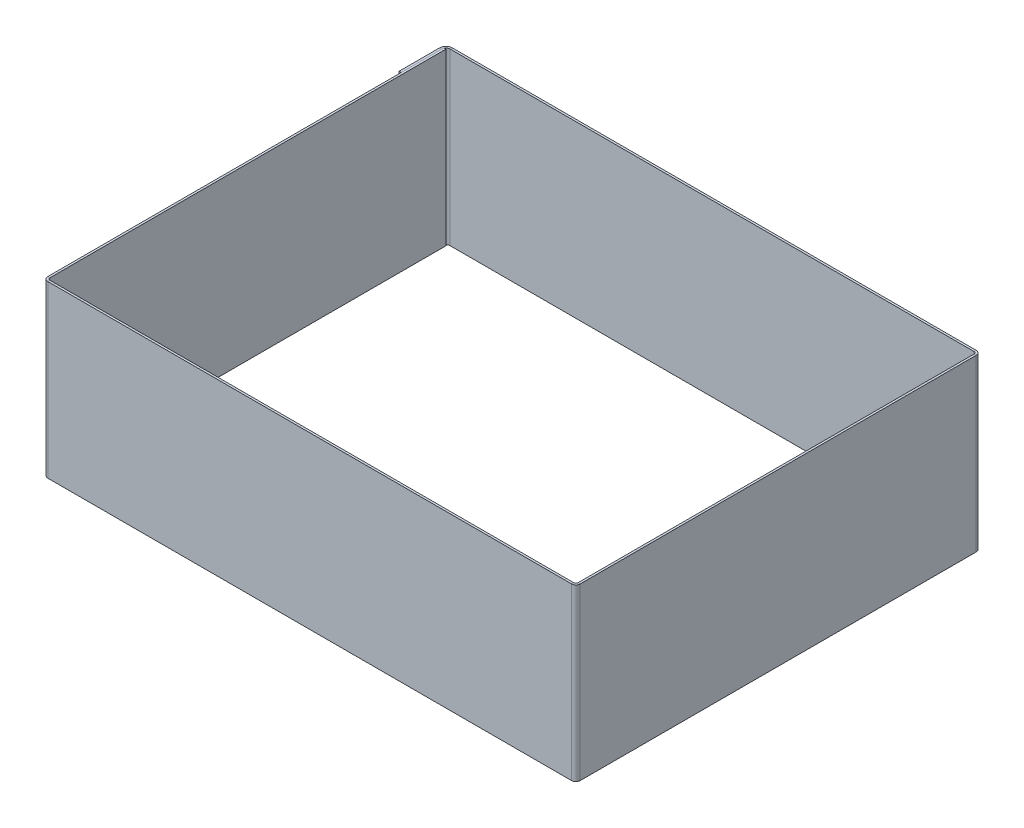
ISO-10303-21;
HEADER;
FILE_DESCRIPTION(('STEP AP214'),'2;1');
FILE_NAME('part.step','',(''),(''),'','','');
FILE_SCHEMA(('AUTOMOTIVE_DESIGN { 1 0 10303 214 1 1 1 1 }'));
ENDSEC;
DATA;
#1=APPLICATION_CONTEXT('core data for automotive mechanical design processes');
#2=APPLICATION_PROTOCOL_DEFINITION('international standard','automotive_design',2000,#1);
#3=PRODUCT_CONTEXT('',#1,'mechanical');
#4=PRODUCT('Part','Part','',(#3));
#5=PRODUCT_RELATED_PRODUCT_CATEGORY('part','',(#4));
#6=PRODUCT_DEFINITION_FORMATION('','',#4);
#7=PRODUCT_DEFINITION_CONTEXT('part definition',#1,'design');
#8=PRODUCT_DEFINITION('design','',#6,#7);
#9=PRODUCT_DEFINITION_SHAPE('','',#8);
#10=(LENGTH_UNIT() NAMED_UNIT(*) SI_UNIT(.MILLI.,.METRE.));
#11=(NAMED_UNIT(*) PLANE_ANGLE_UNIT() SI_UNIT($,.RADIAN.));
#12=(NAMED_UNIT(*) SI_UNIT($,.STERADIAN.) SOLID_ANGLE_UNIT());
#13=UNCERTAINTY_MEASURE_WITH_UNIT(LENGTH_MEASURE(1.E-05),#10,'distance_accuracy_value','');
#14=(GEOMETRIC_REPRESENTATION_CONTEXT(3) GLOBAL_UNCERTAINTY_ASSIGNED_CONTEXT((#13)) GLOBAL_UNIT_ASSIGNED_CONTEXT((#10,
#11,#12)) REPRESENTATION_CONTEXT('',''));
#15=CARTESIAN_POINT('',(0.,0.,0.));
#16=DIRECTION('',(0.,0.,1.));
#17=DIRECTION('',(1.,0.,0.));
#18=AXIS2_PLACEMENT_3D('',#15,#16,#17);
#19=CARTESIAN_POINT('',(-62.5,40.,-46.5));
#20=DIRECTION('',(0.,0.,-1.));
#21=DIRECTION('',(0.,-1.,0.));
#22=AXIS2_PLACEMENT_3D('',#19,#20,#21);
#23=PLANE('',#22);
#24=DIRECTION('',(-1.,0.,0.));
#25=VECTOR('',#24,1.);
#26=CARTESIAN_POINT('',(-62.5,40.,-46.5));
#27=LINE('',#26,#25);
#28=CARTESIAN_POINT('',(-62.,40.,-46.5));
#29=VERTEX_POINT('',#28);
#30=CARTESIAN_POINT('',(-62.5,40.,-46.5));
#31=VERTEX_POINT('',#30);
#32=EDGE_CURVE('E13',#29,#31,#27,.T.);
#33=ORIENTED_EDGE('',*,*,#32,.F.);
#34=DIRECTION('',(0.,1.,0.));
#35=VECTOR('',#34,1.);
#36=CARTESIAN_POINT('',(-62.,40.,-46.5));
#37=LINE('',#36,#35);
#38=CARTESIAN_POINT('',(-62.,0.,-46.5));
#39=VERTEX_POINT('',#38);
#40=EDGE_CURVE('E130',#29,#39,#37,.F.);
#41=ORIENTED_EDGE('',*,*,#40,.T.);
#42=DIRECTION('',(-1.,0.,0.));
#43=VECTOR('',#42,1.);
#44=CARTESIAN_POINT('',(-62.5,0.,-46.5));
#45=LINE('',#44,#43);
#46=CARTESIAN_POINT('',(-62.5,0.,-46.5));
#47=VERTEX_POINT('',#46);
#48=EDGE_CURVE('E73',#39,#47,#45,.T.);
#49=ORIENTED_EDGE('',*,*,#48,.T.);
#50=DIRECTION('',(0.,-1.,0.));
#51=VECTOR('',#50,1.);
#52=CARTESIAN_POINT('',(-62.5,40.,-46.5));
#53=LINE('',#52,#51);
#54=EDGE_CURVE('E133',#31,#47,#53,.T.);
#55=ORIENTED_EDGE('',*,*,#54,.F.);
#56=EDGE_LOOP('',(#33,#41,#49,#55));
#57=FACE_BOUND('',#56,.T.);
#58=ADVANCED_FACE('F63',(#57),#23,.T.);
#59=CARTESIAN_POINT('',(-62.5,0.,47.5));
#60=DIRECTION('',(0.,1.,0.));
#61=DIRECTION('',(0.,0.,-1.));
#62=AXIS2_PLACEMENT_3D('',#59,#60,#61);
#63=PLANE('',#62);
#64=ORIENTED_EDGE('',*,*,#48,.F.);
#65=DIRECTION('',(0.,0.,1.));
#66=VECTOR('',#65,1.);
#67=CARTESIAN_POINT('',(-62.,0.,47.5));
#68=LINE('',#67,#66);
#69=CARTESIAN_POINT('',(-62.,0.,46.5));
#70=VERTEX_POINT('',#69);
#71=EDGE_CURVE('E145',#70,#39,#68,.F.);
#72=ORIENTED_EDGE('',*,*,#71,.F.);
#73=DIRECTION('',(-1.,0.,0.));
#74=VECTOR('',#73,1.);
#75=CARTESIAN_POINT('',(-62.5,0.,46.5));
#76=LINE('',#75,#74);
#77=CARTESIAN_POINT('',(-62.5,0.,46.5));
#78=VERTEX_POINT('',#77);
#79=EDGE_CURVE('E191',#70,#78,#76,.T.);
#80=ORIENTED_EDGE('',*,*,#79,.T.);
#81=DIRECTION('',(0.,0.,-1.));
#82=VECTOR('',#81,1.);
#83=CARTESIAN_POINT('',(-62.5,0.,47.5));
#84=LINE('',#83,#82);
#85=EDGE_CURVE('E199',#78,#47,#84,.T.);
#86=ORIENTED_EDGE('',*,*,#85,.T.);
#87=EDGE_LOOP('',(#64,#72,#80,#86));
#88=FACE_BOUND('',#87,.T.);
#89=ADVANCED_FACE('F203',(#88),#63,.F.);
#90=CARTESIAN_POINT('',(-61.5,0.,46.5));
#91=DIRECTION('',(0.,1.,0.));
#92=DIRECTION('',(0.,0.,1.));
#93=AXIS2_PLACEMENT_3D('',#90,#91,#92);
#94=PLANE('',#93);
#95=ORIENTED_EDGE('',*,*,#79,.F.);
#96=CARTESIAN_POINT('',(-61.5,0.,46.5));
#97=DIRECTION('',(0.,1.,0.));
#98=DIRECTION('',(0.,0.,1.));
#99=AXIS2_PLACEMENT_3D('',#96,#97,#98);
#100=CIRCLE('',#99,0.5);
#101=CARTESIAN_POINT('',(-61.5,0.,47.));
#102=VERTEX_POINT('',#101);
#103=EDGE_CURVE('E239',#102,#70,#100,.F.);
#104=ORIENTED_EDGE('',*,*,#103,.F.);
#105=DIRECTION('',(0.,0.,1.));
#106=VECTOR('',#105,1.);
#107=CARTESIAN_POINT('',(-61.5,0.,47.5));
#108=LINE('',#107,#106);
#109=CARTESIAN_POINT('',(-61.5,0.,47.5));
#110=VERTEX_POINT('',#109);
#111=EDGE_CURVE('E188',#102,#110,#108,.T.);
#112=ORIENTED_EDGE('',*,*,#111,.T.);
#113=CARTESIAN_POINT('',(-61.5,0.,46.5));
#114=DIRECTION('',(0.,-1.,0.));
#115=DIRECTION('',(0.,0.,-1.));
#116=AXIS2_PLACEMENT_3D('',#113,#114,#115);
#117=CIRCLE('',#116,1.);
#118=EDGE_CURVE('E211',#110,#78,#117,.T.);
#119=ORIENTED_EDGE('',*,*,#118,.T.);
#120=EDGE_LOOP('',(#95,#104,#112,#119));
#121=FACE_BOUND('',#120,.T.);
#122=ADVANCED_FACE('F351',(#121),#94,.F.);
#123=CARTESIAN_POINT('',(-62.5,0.,47.5));
#124=DIRECTION('',(0.,1.,0.));
#125=DIRECTION('',(1.,0.,0.));
#126=AXIS2_PLACEMENT_3D('',#123,#124,#125);
#127=PLANE('',#126);
#128=ORIENTED_EDGE('',*,*,#111,.F.);
#129=DIRECTION('',(-1.,0.,0.));
#130=VECTOR('',#129,1.);
#131=CARTESIAN_POINT('',(-62.5,0.,47.));
#132=LINE('',#131,#130);
#133=CARTESIAN_POINT('',(61.5,0.,47.));
#134=VERTEX_POINT('',#133);
#135=EDGE_CURVE('E223',#102,#134,#132,.F.);
#136=ORIENTED_EDGE('',*,*,#135,.T.);
#137=DIRECTION('',(0.,0.,1.));
#138=VECTOR('',#137,1.);
#139=CARTESIAN_POINT('',(61.5,0.,47.5));
#140=LINE('',#139,#138);
#141=CARTESIAN_POINT('',(61.5,0.,47.5));
#142=VERTEX_POINT('',#141);
#143=EDGE_CURVE('E185',#134,#142,#140,.T.);
#144=ORIENTED_EDGE('',*,*,#143,.T.);
#145=DIRECTION('',(1.,0.,0.));
#146=VECTOR('',#145,1.);
#147=CARTESIAN_POINT('',(-62.5,0.,47.5));
#148=LINE('',#147,#146);
#149=EDGE_CURVE('E304',#110,#142,#148,.T.);
#150=ORIENTED_EDGE('',*,*,#149,.F.);
#151=EDGE_LOOP('',(#128,#136,#144,#150));
#152=FACE_BOUND('',#151,.T.);
#153=ADVANCED_FACE('F355',(#152),#127,.F.);
#154=CARTESIAN_POINT('',(61.5,0.,46.5));
#155=DIRECTION('',(0.,1.,0.));
#156=DIRECTION('',(0.,0.,1.));
#157=AXIS2_PLACEMENT_3D('',#154,#155,#156);
#158=PLANE('',#157);
#159=ORIENTED_EDGE('',*,*,#143,.F.);
#160=CARTESIAN_POINT('',(61.5,0.,46.5));
#161=DIRECTION('',(0.,-1.,0.));
#162=DIRECTION('',(0.,0.,-1.));
#163=AXIS2_PLACEMENT_3D('',#160,#161,#162);
#164=CIRCLE('',#163,0.5);
#165=CARTESIAN_POINT('',(62.,0.,46.5));
#166=VERTEX_POINT('',#165);
#167=EDGE_CURVE('E148',#166,#134,#164,.T.);
#168=ORIENTED_EDGE('',*,*,#167,.F.);
#169=DIRECTION('',(1.,0.,0.));
#170=VECTOR('',#169,1.);
#171=CARTESIAN_POINT('',(62.5,0.,46.5));
#172=LINE('',#171,#170);
#173=CARTESIAN_POINT('',(62.5,0.,46.5));
#174=VERTEX_POINT('',#173);
#175=EDGE_CURVE('E182',#166,#174,#172,.T.);
#176=ORIENTED_EDGE('',*,*,#175,.T.);
#177=CARTESIAN_POINT('',(61.5,0.,46.5));
#178=DIRECTION('',(0.,-1.,0.));
#179=DIRECTION('',(0.,0.,-1.));
#180=AXIS2_PLACEMENT_3D('',#177,#178,#179);
#181=CIRCLE('',#180,1.);
#182=EDGE_CURVE('E319',#174,#142,#181,.T.);
#183=ORIENTED_EDGE('',*,*,#182,.T.);
#184=EDGE_LOOP('',(#159,#168,#176,#183));
#185=FACE_BOUND('',#184,.T.);
#186=ADVANCED_FACE('F325',(#185),#158,.F.);
#187=CARTESIAN_POINT('',(62.5,0.,47.5));
#188=DIRECTION('',(0.,1.,0.));
#189=DIRECTION('',(0.,0.,-1.));
#190=AXIS2_PLACEMENT_3D('',#187,#188,#189);
#191=PLANE('',#190);
#192=ORIENTED_EDGE('',*,*,#175,.F.);
#193=DIRECTION('',(0.,0.,1.));
#194=VECTOR('',#193,1.);
#195=CARTESIAN_POINT('',(62.,0.,47.5));
#196=LINE('',#195,#194);
#197=CARTESIAN_POINT('',(62.,0.,-46.5));
#198=VERTEX_POINT('',#197);
#199=EDGE_CURVE('E227',#166,#198,#196,.F.);
#200=ORIENTED_EDGE('',*,*,#199,.T.);
#201=DIRECTION('',(1.,0.,0.));
#202=VECTOR('',#201,1.);
#203=CARTESIAN_POINT('',(62.5,0.,-46.5));
#204=LINE('',#203,#202);
#205=CARTESIAN_POINT('',(62.5,0.,-46.5));
#206=VERTEX_POINT('',#205);
#207=EDGE_CURVE('E179',#198,#206,#204,.T.);
#208=ORIENTED_EDGE('',*,*,#207,.T.);
#209=DIRECTION('',(0.,0.,-1.));
#210=VECTOR('',#209,1.);
#211=CARTESIAN_POINT('',(62.5,0.,47.5));
#212=LINE('',#211,#210);
#213=EDGE_CURVE('E276',#174,#206,#212,.T.);
#214=ORIENTED_EDGE('',*,*,#213,.F.);
#215=EDGE_LOOP('',(#192,#200,#208,#214));
#216=FACE_BOUND('',#215,.T.);
#217=ADVANCED_FACE('F377',(#216),#191,.F.);
#218=CARTESIAN_POINT('',(61.5,0.,-46.5));
#219=DIRECTION('',(0.,1.,0.));
#220=DIRECTION('',(0.,0.,1.));
#221=AXIS2_PLACEMENT_3D('',#218,#219,#220);
#222=PLANE('',#221);
#223=ORIENTED_EDGE('',*,*,#207,.F.);
#224=CARTESIAN_POINT('',(61.5,0.,-46.5));
#225=DIRECTION('',(0.,1.,0.));
#226=DIRECTION('',(0.,0.,1.));
#227=AXIS2_PLACEMENT_3D('',#224,#225,#226);
#228=CIRCLE('',#227,0.5);
#229=CARTESIAN_POINT('',(61.5,0.,-47.));
#230=VERTEX_POINT('',#229);
#231=EDGE_CURVE('E250',#230,#198,#228,.F.);
#232=ORIENTED_EDGE('',*,*,#231,.F.);
#233=DIRECTION('',(0.,0.,-1.));
#234=VECTOR('',#233,1.);
#235=CARTESIAN_POINT('',(61.5,0.,-47.5));
#236=LINE('',#235,#234);
#237=CARTESIAN_POINT('',(61.5,0.,-47.5));
#238=VERTEX_POINT('',#237);
#239=EDGE_CURVE('E176',#230,#238,#236,.T.);
#240=ORIENTED_EDGE('',*,*,#239,.T.);
#241=CARTESIAN_POINT('',(61.5,0.,-46.5));
#242=DIRECTION('',(0.,-1.,0.));
#243=DIRECTION('',(0.,0.,-1.));
#244=AXIS2_PLACEMENT_3D('',#241,#242,#243);
#245=CIRCLE('',#244,1.);
#246=EDGE_CURVE('E301',#238,#206,#245,.T.);
#247=ORIENTED_EDGE('',*,*,#246,.T.);
#248=EDGE_LOOP('',(#223,#232,#240,#247));
#249=FACE_BOUND('',#248,.T.);
#250=ADVANCED_FACE('F544',(#249),#222,.F.);
#251=CARTESIAN_POINT('',(-62.5,0.,-47.5));
#252=DIRECTION('',(0.,1.,0.));
#253=DIRECTION('',(1.,0.,0.));
#254=AXIS2_PLACEMENT_3D('',#251,#252,#253);
#255=PLANE('',#254);
#256=ORIENTED_EDGE('',*,*,#239,.F.);
#257=DIRECTION('',(-1.,0.,0.));
#258=VECTOR('',#257,1.);
#259=CARTESIAN_POINT('',(-62.5,0.,-47.));
#260=LINE('',#259,#258);
#261=CARTESIAN_POINT('',(-61.5,0.,-47.));
#262=VERTEX_POINT('',#261);
#263=EDGE_CURVE('E236',#262,#230,#260,.F.);
#264=ORIENTED_EDGE('',*,*,#263,.F.);
#265=DIRECTION('',(0.,0.,-1.));
#266=VECTOR('',#265,1.);
#267=CARTESIAN_POINT('',(-61.5,0.,-47.5));
#268=LINE('',#267,#266);
#269=CARTESIAN_POINT('',(-61.5,0.,-47.5));
#270=VERTEX_POINT('',#269);
#271=EDGE_CURVE('E173',#262,#270,#268,.T.);
#272=ORIENTED_EDGE('',*,*,#271,.T.);
#273=DIRECTION('',(1.,0.,0.));
#274=VECTOR('',#273,1.);
#275=CARTESIAN_POINT('',(-62.5,0.,-47.5));
#276=LINE('',#275,#274);
#277=EDGE_CURVE('E292',#270,#238,#276,.T.);
#278=ORIENTED_EDGE('',*,*,#277,.T.);
#279=EDGE_LOOP('',(#256,#264,#272,#278));
#280=FACE_BOUND('',#279,.T.);
#281=ADVANCED_FACE('F442',(#280),#255,.F.);
#282=CARTESIAN_POINT('',(-62.5,40.,-47.5));
#283=DIRECTION('',(0.,1.,0.));
#284=DIRECTION('',(1.,0.,0.));
#285=AXIS2_PLACEMENT_3D('',#282,#283,#284);
#286=PLANE('',#285);
#287=DIRECTION('',(0.,0.,-1.));
#288=VECTOR('',#287,1.);
#289=CARTESIAN_POINT('',(-61.5,40.,-47.5));
#290=LINE('',#289,#288);
#291=CARTESIAN_POINT('',(-61.5,40.,-47.));
#292=VERTEX_POINT('',#291);
#293=CARTESIAN_POINT('',(-61.5,40.,-47.5));
#294=VERTEX_POINT('',#293);
#295=EDGE_CURVE('E170',#292,#294,#290,.T.);
#296=ORIENTED_EDGE('',*,*,#295,.F.);
#297=DIRECTION('',(-1.,0.,0.));
#298=VECTOR('',#297,1.);
#299=CARTESIAN_POINT('',(-62.5,40.,-47.));
#300=LINE('',#299,#298);
#301=CARTESIAN_POINT('',(61.5,40.,-47.));
#302=VERTEX_POINT('',#301);
#303=EDGE_CURVE('E232',#292,#302,#300,.F.);
#304=ORIENTED_EDGE('',*,*,#303,.T.);
#305=DIRECTION('',(0.,0.,-1.));
#306=VECTOR('',#305,1.);
#307=CARTESIAN_POINT('',(61.5,40.,-47.5));
#308=LINE('',#307,#306);
#309=CARTESIAN_POINT('',(61.5,40.,-47.5));
#310=VERTEX_POINT('',#309);
#311=EDGE_CURVE('E167',#302,#310,#308,.T.);
#312=ORIENTED_EDGE('',*,*,#311,.T.);
#313=DIRECTION('',(1.,0.,0.));
#314=VECTOR('',#313,1.);
#315=CARTESIAN_POINT('',(-62.5,40.,-47.5));
#316=LINE('',#315,#314);
#317=EDGE_CURVE('E286',#294,#310,#316,.T.);
#318=ORIENTED_EDGE('',*,*,#317,.F.);
#319=EDGE_LOOP('',(#296,#304,#312,#318));
#320=FACE_BOUND('',#319,.T.);
#321=ADVANCED_FACE('F421',(#320),#286,.T.);
#322=CARTESIAN_POINT('',(61.5,40.,-46.5));
#323=DIRECTION('',(0.,1.,0.));
#324=DIRECTION('',(0.,0.,1.));
#325=AXIS2_PLACEMENT_3D('',#322,#323,#324);
#326=PLANE('',#325);
#327=ORIENTED_EDGE('',*,*,#311,.F.);
#328=CARTESIAN_POINT('',(61.5,40.,-46.5));
#329=DIRECTION('',(0.,1.,0.));
#330=DIRECTION('',(0.,0.,1.));
#331=AXIS2_PLACEMENT_3D('',#328,#329,#330);
#332=CIRCLE('',#331,0.5);
#333=CARTESIAN_POINT('',(62.,40.,-46.5));
#334=VERTEX_POINT('',#333);
#335=EDGE_CURVE('E247',#334,#302,#332,.T.);
#336=ORIENTED_EDGE('',*,*,#335,.F.);
#337=DIRECTION('',(1.,0.,0.));
#338=VECTOR('',#337,1.);
#339=CARTESIAN_POINT('',(62.5,40.,-46.5));
#340=LINE('',#339,#338);
#341=CARTESIAN_POINT('',(62.5,40.,-46.5));
#342=VERTEX_POINT('',#341);
#343=EDGE_CURVE('E164',#334,#342,#340,.T.);
#344=ORIENTED_EDGE('',*,*,#343,.T.);
#345=CARTESIAN_POINT('',(61.5,40.,-46.5));
#346=DIRECTION('',(0.,-1.,0.));
#347=DIRECTION('',(0.,0.,-1.));
#348=AXIS2_PLACEMENT_3D('',#345,#346,#347);
#349=CIRCLE('',#348,1.);
#350=EDGE_CURVE('E298',#342,#310,#349,.F.);
#351=ORIENTED_EDGE('',*,*,#350,.T.);
#352=EDGE_LOOP('',(#327,#336,#344,#351));
#353=FACE_BOUND('',#352,.T.);
#354=ADVANCED_FACE('F425',(#353),#326,.T.);
#355=CARTESIAN_POINT('',(62.5,40.,47.5));
#356=DIRECTION('',(0.,1.,0.));
#357=DIRECTION('',(0.,0.,-1.));
#358=AXIS2_PLACEMENT_3D('',#355,#356,#357);
#359=PLANE('',#358);
#360=ORIENTED_EDGE('',*,*,#343,.F.);
#361=DIRECTION('',(0.,0.,1.));
#362=VECTOR('',#361,1.);
#363=CARTESIAN_POINT('',(62.,40.,47.5));
#364=LINE('',#363,#362);
#365=CARTESIAN_POINT('',(62.,40.,46.5));
#366=VERTEX_POINT('',#365);
#367=EDGE_CURVE('E228',#366,#334,#364,.F.);
#368=ORIENTED_EDGE('',*,*,#367,.F.);
#369=DIRECTION('',(1.,0.,0.));
#370=VECTOR('',#369,1.);
#371=CARTESIAN_POINT('',(62.5,40.,46.5));
#372=LINE('',#371,#370);
#373=CARTESIAN_POINT('',(62.5,40.,46.5));
#374=VERTEX_POINT('',#373);
#375=EDGE_CURVE('E161',#366,#374,#372,.T.);
#376=ORIENTED_EDGE('',*,*,#375,.T.);
#377=DIRECTION('',(0.,0.,-1.));
#378=VECTOR('',#377,1.);
#379=CARTESIAN_POINT('',(62.5,40.,47.5));
#380=LINE('',#379,#378);
#381=EDGE_CURVE('E265',#374,#342,#380,.T.);
#382=ORIENTED_EDGE('',*,*,#381,.T.);
#383=EDGE_LOOP('',(#360,#368,#376,#382));
#384=FACE_BOUND('',#383,.T.);
#385=ADVANCED_FACE('F435',(#384),#359,.T.);
#386=CARTESIAN_POINT('',(61.5,40.,46.5));
#387=DIRECTION('',(0.,1.,0.));
#388=DIRECTION('',(0.,0.,1.));
#389=AXIS2_PLACEMENT_3D('',#386,#387,#388);
#390=PLANE('',#389);
#391=ORIENTED_EDGE('',*,*,#375,.F.);
#392=CARTESIAN_POINT('',(61.5,40.,46.5));
#393=DIRECTION('',(0.,-1.,0.));
#394=DIRECTION('',(0.,0.,-1.));
#395=AXIS2_PLACEMENT_3D('',#392,#393,#394);
#396=CIRCLE('',#395,0.5);
#397=CARTESIAN_POINT('',(61.5,40.,47.));
#398=VERTEX_POINT('',#397);
#399=EDGE_CURVE('E151',#398,#366,#396,.F.);
#400=ORIENTED_EDGE('',*,*,#399,.F.);
#401=DIRECTION('',(0.,0.,1.));
#402=VECTOR('',#401,1.);
#403=CARTESIAN_POINT('',(61.5,40.,47.5));
#404=LINE('',#403,#402);
#405=CARTESIAN_POINT('',(61.5,40.,47.5));
#406=VERTEX_POINT('',#405);
#407=EDGE_CURVE('E158',#398,#406,#404,.T.);
#408=ORIENTED_EDGE('',*,*,#407,.T.);
#409=CARTESIAN_POINT('',(61.5,40.,46.5));
#410=DIRECTION('',(0.,-1.,0.));
#411=DIRECTION('',(0.,0.,-1.));
#412=AXIS2_PLACEMENT_3D('',#409,#410,#411);
#413=CIRCLE('',#412,1.);
#414=EDGE_CURVE('E316',#406,#374,#413,.F.);
#415=ORIENTED_EDGE('',*,*,#414,.T.);
#416=EDGE_LOOP('',(#391,#400,#408,#415));
#417=FACE_BOUND('',#416,.T.);
#418=ADVANCED_FACE('F555',(#417),#390,.T.);
#419=CARTESIAN_POINT('',(-62.5,40.,47.5));
#420=DIRECTION('',(0.,1.,0.));
#421=DIRECTION('',(1.,0.,0.));
#422=AXIS2_PLACEMENT_3D('',#419,#420,#421);
#423=PLANE('',#422);
#424=ORIENTED_EDGE('',*,*,#407,.F.);
#425=DIRECTION('',(-1.,0.,0.));
#426=VECTOR('',#425,1.);
#427=CARTESIAN_POINT('',(-62.5,40.,47.));
#428=LINE('',#427,#426);
#429=CARTESIAN_POINT('',(-61.5,40.,47.));
#430=VERTEX_POINT('',#429);
#431=EDGE_CURVE('E219',#430,#398,#428,.F.);
#432=ORIENTED_EDGE('',*,*,#431,.F.);
#433=DIRECTION('',(0.,0.,1.));
#434=VECTOR('',#433,1.);
#435=CARTESIAN_POINT('',(-61.5,40.,47.5));
#436=LINE('',#435,#434);
#437=CARTESIAN_POINT('',(-61.5,40.,47.5));
#438=VERTEX_POINT('',#437);
#439=EDGE_CURVE('E155',#430,#438,#436,.T.);
#440=ORIENTED_EDGE('',*,*,#439,.T.);
#441=DIRECTION('',(1.,0.,0.));
#442=VECTOR('',#441,1.);
#443=CARTESIAN_POINT('',(-62.5,40.,47.5));
#444=LINE('',#443,#442);
#445=EDGE_CURVE('E310',#438,#406,#444,.T.);
#446=ORIENTED_EDGE('',*,*,#445,.T.);
#447=EDGE_LOOP('',(#424,#432,#440,#446));
#448=FACE_BOUND('',#447,.T.);
#449=ADVANCED_FACE('F367',(#448),#423,.T.);
#450=CARTESIAN_POINT('',(-61.5,40.,46.5));
#451=DIRECTION('',(0.,1.,0.));
#452=DIRECTION('',(0.,0.,1.));
#453=AXIS2_PLACEMENT_3D('',#450,#451,#452);
#454=PLANE('',#453);
#455=ORIENTED_EDGE('',*,*,#439,.F.);
#456=CARTESIAN_POINT('',(-61.5,40.,46.5));
#457=DIRECTION('',(0.,1.,0.));
#458=DIRECTION('',(0.,0.,1.));
#459=AXIS2_PLACEMENT_3D('',#456,#457,#458);
#460=CIRCLE('',#459,0.5);
#461=CARTESIAN_POINT('',(-62.,40.,46.5));
#462=VERTEX_POINT('',#461);
#463=EDGE_CURVE('E215',#462,#430,#460,.T.);
#464=ORIENTED_EDGE('',*,*,#463,.F.);
#465=DIRECTION('',(-1.,0.,0.));
#466=VECTOR('',#465,1.);
#467=CARTESIAN_POINT('',(-62.5,40.,46.5));
#468=LINE('',#467,#466);
#469=CARTESIAN_POINT('',(-62.5,40.,46.5));
#470=VERTEX_POINT('',#469);
#471=EDGE_CURVE('E67',#462,#470,#468,.T.);
#472=ORIENTED_EDGE('',*,*,#471,.T.);
#473=CARTESIAN_POINT('',(-61.5,40.,46.5));
#474=DIRECTION('',(0.,-1.,0.));
#475=DIRECTION('',(0.,0.,-1.));
#476=AXIS2_PLACEMENT_3D('',#473,#474,#475);
#477=CIRCLE('',#476,1.);
#478=EDGE_CURVE('E206',#470,#438,#477,.F.);
#479=ORIENTED_EDGE('',*,*,#478,.T.);
#480=EDGE_LOOP('',(#455,#464,#472,#479));
#481=FACE_BOUND('',#480,.T.);
#482=ADVANCED_FACE('F359',(#481),#454,.T.);
#483=CARTESIAN_POINT('',(-62.5,40.,47.5));
#484=DIRECTION('',(0.,1.,0.));
#485=DIRECTION('',(0.,0.,-1.));
#486=AXIS2_PLACEMENT_3D('',#483,#484,#485);
#487=PLANE('',#486);
#488=DIRECTION('',(0.,0.,1.));
#489=VECTOR('',#488,1.);
#490=CARTESIAN_POINT('',(-62.,40.,47.5));
#491=LINE('',#490,#489);
#492=EDGE_CURVE('E143',#462,#29,#491,.F.);
#493=ORIENTED_EDGE('',*,*,#492,.T.);
#494=ORIENTED_EDGE('',*,*,#32,.T.);
#495=DIRECTION('',(0.,0.,-1.));
#496=VECTOR('',#495,1.);
#497=CARTESIAN_POINT('',(-62.5,40.,47.5));
#498=LINE('',#497,#496);
#499=EDGE_CURVE('E201',#470,#31,#498,.T.);
#500=ORIENTED_EDGE('',*,*,#499,.F.);
#501=ORIENTED_EDGE('',*,*,#471,.F.);
#502=EDGE_LOOP('',(#493,#494,#500,#501));
#503=FACE_BOUND('',#502,.T.);
#504=ADVANCED_FACE('F65',(#503),#487,.T.);
#505=CARTESIAN_POINT('',(-61.5,40.,46.5));
#506=DIRECTION('',(0.,1.,0.));
#507=DIRECTION('',(0.,0.,1.));
#508=AXIS2_PLACEMENT_3D('',#505,#506,#507);
#509=CYLINDRICAL_SURFACE('',#508,1.);
#510=ORIENTED_EDGE('',*,*,#478,.F.);
#511=DIRECTION('',(0.,-1.,0.));
#512=VECTOR('',#511,1.);
#513=CARTESIAN_POINT('',(-62.5,40.,46.5));
#514=LINE('',#513,#512);
#515=EDGE_CURVE('E204',#78,#470,#514,.F.);
#516=ORIENTED_EDGE('',*,*,#515,.F.);
#517=ORIENTED_EDGE('',*,*,#118,.F.);
#518=DIRECTION('',(0.,-1.,0.));
#519=VECTOR('',#518,1.);
#520=CARTESIAN_POINT('',(-61.5,0.,47.5));
#521=LINE('',#520,#519);
#522=EDGE_CURVE('E313',#438,#110,#521,.T.);
#523=ORIENTED_EDGE('',*,*,#522,.F.);
#524=EDGE_LOOP('',(#510,#516,#517,#523));
#525=FACE_BOUND('',#524,.T.);
#526=ADVANCED_FACE('F358',(#525),#509,.T.);
#527=CARTESIAN_POINT('',(-62.5,40.,47.5));
#528=DIRECTION('',(-1.,0.,0.));
#529=DIRECTION('',(0.,0.,1.));
#530=AXIS2_PLACEMENT_3D('',#527,#528,#529);
#531=PLANE('',#530);
#532=ORIENTED_EDGE('',*,*,#499,.T.);
#533=ORIENTED_EDGE('',*,*,#54,.T.);
#534=ORIENTED_EDGE('',*,*,#85,.F.);
#535=ORIENTED_EDGE('',*,*,#515,.T.);
#536=EDGE_LOOP('',(#532,#533,#534,#535));
#537=FACE_BOUND('',#536,.T.);
#538=ADVANCED_FACE('F197',(#537),#531,.T.);
#539=CARTESIAN_POINT('',(61.5,40.,46.5));
#540=DIRECTION('',(0.,-1.,0.));
#541=DIRECTION('',(0.,0.,-1.));
#542=AXIS2_PLACEMENT_3D('',#539,#540,#541);
#543=CYLINDRICAL_SURFACE('',#542,1.);
#544=ORIENTED_EDGE('',*,*,#414,.F.);
#545=DIRECTION('',(0.,-1.,0.));
#546=VECTOR('',#545,1.);
#547=CARTESIAN_POINT('',(61.5,40.,47.5));
#548=LINE('',#547,#546);
#549=EDGE_CURVE('E307',#142,#406,#548,.F.);
#550=ORIENTED_EDGE('',*,*,#549,.F.);
#551=ORIENTED_EDGE('',*,*,#182,.F.);
#552=DIRECTION('',(0.,-1.,0.));
#553=VECTOR('',#552,1.);
#554=CARTESIAN_POINT('',(62.5,40.,46.5));
#555=LINE('',#554,#553);
#556=EDGE_CURVE('E269',#374,#174,#555,.T.);
#557=ORIENTED_EDGE('',*,*,#556,.F.);
#558=EDGE_LOOP('',(#544,#550,#551,#557));
#559=FACE_BOUND('',#558,.T.);
#560=ADVANCED_FACE('F336',(#559),#543,.T.);
#561=CARTESIAN_POINT('',(-62.5,40.,47.5));
#562=DIRECTION('',(0.,0.,-1.));
#563=DIRECTION('',(-1.,0.,0.));
#564=AXIS2_PLACEMENT_3D('',#561,#562,#563);
#565=PLANE('',#564);
#566=ORIENTED_EDGE('',*,*,#149,.T.);
#567=ORIENTED_EDGE('',*,*,#549,.T.);
#568=ORIENTED_EDGE('',*,*,#445,.F.);
#569=ORIENTED_EDGE('',*,*,#522,.T.);
#570=EDGE_LOOP('',(#566,#567,#568,#569));
#571=FACE_BOUND('',#570,.T.);
#572=ADVANCED_FACE('F339',(#571),#565,.F.);
#573=CARTESIAN_POINT('',(61.5,40.,-46.5));
#574=DIRECTION('',(0.,1.,0.));
#575=DIRECTION('',(0.,0.,1.));
#576=AXIS2_PLACEMENT_3D('',#573,#574,#575);
#577=CYLINDRICAL_SURFACE('',#576,1.);
#578=ORIENTED_EDGE('',*,*,#350,.F.);
#579=DIRECTION('',(0.,-1.,0.));
#580=VECTOR('',#579,1.);
#581=CARTESIAN_POINT('',(62.5,40.,-46.5));
#582=LINE('',#581,#580);
#583=EDGE_CURVE('E284',#206,#342,#582,.F.);
#584=ORIENTED_EDGE('',*,*,#583,.F.);
#585=ORIENTED_EDGE('',*,*,#246,.F.);
#586=DIRECTION('',(0.,-1.,0.));
#587=VECTOR('',#586,1.);
#588=CARTESIAN_POINT('',(61.5,0.,-47.5));
#589=LINE('',#588,#587);
#590=EDGE_CURVE('E289',#310,#238,#589,.T.);
#591=ORIENTED_EDGE('',*,*,#590,.F.);
#592=EDGE_LOOP('',(#578,#584,#585,#591));
#593=FACE_BOUND('',#592,.T.);
#594=ADVANCED_FACE('F438',(#593),#577,.T.);
#595=CARTESIAN_POINT('',(-62.5,40.,-47.5));
#596=DIRECTION('',(0.,0.,-1.));
#597=DIRECTION('',(-1.,0.,0.));
#598=AXIS2_PLACEMENT_3D('',#595,#596,#597);
#599=PLANE('',#598);
#600=ORIENTED_EDGE('',*,*,#317,.T.);
#601=ORIENTED_EDGE('',*,*,#590,.T.);
#602=ORIENTED_EDGE('',*,*,#277,.F.);
#603=DIRECTION('',(0.,-1.,0.));
#604=VECTOR('',#603,1.);
#605=CARTESIAN_POINT('',(-61.5,40.,-47.5));
#606=LINE('',#605,#604);
#607=EDGE_CURVE('E295',#270,#294,#606,.F.);
#608=ORIENTED_EDGE('',*,*,#607,.T.);
#609=EDGE_LOOP('',(#600,#601,#602,#608));
#610=FACE_BOUND('',#609,.T.);
#611=ADVANCED_FACE('F420',(#610),#599,.T.);
#612=CARTESIAN_POINT('',(62.5,40.,47.5));
#613=DIRECTION('',(-1.,0.,0.));
#614=DIRECTION('',(0.,0.,1.));
#615=AXIS2_PLACEMENT_3D('',#612,#613,#614);
#616=PLANE('',#615);
#617=ORIENTED_EDGE('',*,*,#381,.F.);
#618=ORIENTED_EDGE('',*,*,#556,.T.);
#619=ORIENTED_EDGE('',*,*,#213,.T.);
#620=ORIENTED_EDGE('',*,*,#583,.T.);
#621=EDGE_LOOP('',(#617,#618,#619,#620));
#622=FACE_BOUND('',#621,.T.);
#623=ADVANCED_FACE('F382',(#622),#616,.F.);
#624=CARTESIAN_POINT('',(-61.5,40.,46.5));
#625=DIRECTION('',(0.,1.,0.));
#626=DIRECTION('',(0.,0.,1.));
#627=AXIS2_PLACEMENT_3D('',#624,#625,#626);
#628=CYLINDRICAL_SURFACE('',#627,0.5);
#629=ORIENTED_EDGE('',*,*,#463,.T.);
#630=DIRECTION('',(0.,1.,0.));
#631=VECTOR('',#630,1.);
#632=CARTESIAN_POINT('',(-61.5,40.,47.));
#633=LINE('',#632,#631);
#634=EDGE_CURVE('E216',#430,#102,#633,.F.);
#635=ORIENTED_EDGE('',*,*,#634,.T.);
#636=ORIENTED_EDGE('',*,*,#103,.T.);
#637=DIRECTION('',(0.,1.,0.));
#638=VECTOR('',#637,1.);
#639=CARTESIAN_POINT('',(-62.,40.,46.5));
#640=LINE('',#639,#638);
#641=EDGE_CURVE('E213',#70,#462,#640,.T.);
#642=ORIENTED_EDGE('',*,*,#641,.T.);
#643=EDGE_LOOP('',(#629,#635,#636,#642));
#644=FACE_BOUND('',#643,.T.);
#645=ADVANCED_FACE('F366',(#644),#628,.F.);
#646=CARTESIAN_POINT('',(-62.,40.,47.5));
#647=DIRECTION('',(-1.,0.,0.));
#648=DIRECTION('',(0.,0.,1.));
#649=AXIS2_PLACEMENT_3D('',#646,#647,#648);
#650=PLANE('',#649);
#651=ORIENTED_EDGE('',*,*,#492,.F.);
#652=ORIENTED_EDGE('',*,*,#641,.F.);
#653=ORIENTED_EDGE('',*,*,#71,.T.);
#654=ORIENTED_EDGE('',*,*,#40,.F.);
#655=EDGE_LOOP('',(#651,#652,#653,#654));
#656=FACE_BOUND('',#655,.T.);
#657=ADVANCED_FACE('F141',(#656),#650,.F.);
#658=CARTESIAN_POINT('',(61.5,40.,46.5));
#659=DIRECTION('',(0.,-1.,0.));
#660=DIRECTION('',(0.,0.,-1.));
#661=AXIS2_PLACEMENT_3D('',#658,#659,#660);
#662=CYLINDRICAL_SURFACE('',#661,0.5);
#663=ORIENTED_EDGE('',*,*,#399,.T.);
#664=DIRECTION('',(0.,1.,0.));
#665=VECTOR('',#664,1.);
#666=CARTESIAN_POINT('',(62.,40.,46.5));
#667=LINE('',#666,#665);
#668=EDGE_CURVE('E224',#366,#166,#667,.F.);
#669=ORIENTED_EDGE('',*,*,#668,.T.);
#670=ORIENTED_EDGE('',*,*,#167,.T.);
#671=DIRECTION('',(0.,1.,0.));
#672=VECTOR('',#671,1.);
#673=CARTESIAN_POINT('',(61.5,40.,47.));
#674=LINE('',#673,#672);
#675=EDGE_CURVE('E220',#134,#398,#674,.T.);
#676=ORIENTED_EDGE('',*,*,#675,.T.);
#677=EDGE_LOOP('',(#663,#669,#670,#676));
#678=FACE_BOUND('',#677,.T.);
#679=ADVANCED_FACE('F369',(#678),#662,.F.);
#680=CARTESIAN_POINT('',(-62.5,40.,47.));
#681=DIRECTION('',(0.,0.,-1.));
#682=DIRECTION('',(-1.,0.,0.));
#683=AXIS2_PLACEMENT_3D('',#680,#681,#682);
#684=PLANE('',#683);
#685=ORIENTED_EDGE('',*,*,#135,.F.);
#686=ORIENTED_EDGE('',*,*,#634,.F.);
#687=ORIENTED_EDGE('',*,*,#431,.T.);
#688=ORIENTED_EDGE('',*,*,#675,.F.);
#689=EDGE_LOOP('',(#685,#686,#687,#688));
#690=FACE_BOUND('',#689,.T.);
#691=ADVANCED_FACE('F365',(#690),#684,.T.);
#692=CARTESIAN_POINT('',(61.5,40.,-46.5));
#693=DIRECTION('',(0.,1.,0.));
#694=DIRECTION('',(0.,0.,1.));
#695=AXIS2_PLACEMENT_3D('',#692,#693,#694);
#696=CYLINDRICAL_SURFACE('',#695,0.5);
#697=ORIENTED_EDGE('',*,*,#335,.T.);
#698=DIRECTION('',(0.,1.,0.));
#699=VECTOR('',#698,1.);
#700=CARTESIAN_POINT('',(61.5,40.,-47.));
#701=LINE('',#700,#699);
#702=EDGE_CURVE('E233',#302,#230,#701,.F.);
#703=ORIENTED_EDGE('',*,*,#702,.T.);
#704=ORIENTED_EDGE('',*,*,#231,.T.);
#705=DIRECTION('',(0.,1.,0.));
#706=VECTOR('',#705,1.);
#707=CARTESIAN_POINT('',(62.,40.,-46.5));
#708=LINE('',#707,#706);
#709=EDGE_CURVE('E229',#198,#334,#708,.T.);
#710=ORIENTED_EDGE('',*,*,#709,.T.);
#711=EDGE_LOOP('',(#697,#703,#704,#710));
#712=FACE_BOUND('',#711,.T.);
#713=ADVANCED_FACE('F434',(#712),#696,.F.);
#714=CARTESIAN_POINT('',(-62.5,40.,-47.));
#715=DIRECTION('',(0.,0.,-1.));
#716=DIRECTION('',(-1.,0.,0.));
#717=AXIS2_PLACEMENT_3D('',#714,#715,#716);
#718=PLANE('',#717);
#719=ORIENTED_EDGE('',*,*,#303,.F.);
#720=DIRECTION('',(0.,1.,0.));
#721=VECTOR('',#720,1.);
#722=CARTESIAN_POINT('',(-61.5,40.,-47.));
#723=LINE('',#722,#721);
#724=EDGE_CURVE('E251',#262,#292,#723,.T.);
#725=ORIENTED_EDGE('',*,*,#724,.F.);
#726=ORIENTED_EDGE('',*,*,#263,.T.);
#727=ORIENTED_EDGE('',*,*,#702,.F.);
#728=EDGE_LOOP('',(#719,#725,#726,#727));
#729=FACE_BOUND('',#728,.T.);
#730=ADVANCED_FACE('F429',(#729),#718,.F.);
#731=CARTESIAN_POINT('',(62.,40.,47.5));
#732=DIRECTION('',(-1.,0.,0.));
#733=DIRECTION('',(0.,0.,1.));
#734=AXIS2_PLACEMENT_3D('',#731,#732,#733);
#735=PLANE('',#734);
#736=ORIENTED_EDGE('',*,*,#367,.T.);
#737=ORIENTED_EDGE('',*,*,#709,.F.);
#738=ORIENTED_EDGE('',*,*,#199,.F.);
#739=ORIENTED_EDGE('',*,*,#668,.F.);
#740=EDGE_LOOP('',(#736,#737,#738,#739));
#741=FACE_BOUND('',#740,.T.);
#742=ADVANCED_FACE('F375',(#741),#735,.T.);
#743=CARTESIAN_POINT('',(-61.5,40.,-46.));
#744=DIRECTION('',(0.,1.,0.));
#745=DIRECTION('',(0.,0.,1.));
#746=AXIS2_PLACEMENT_3D('',#743,#744,#745);
#747=PLANE('',#746);
#748=DIRECTION('',(-1.,0.,0.));
#749=VECTOR('',#748,1.);
#750=CARTESIAN_POINT('',(-63.,40.,-46.));
#751=LINE('',#750,#749);
#752=CARTESIAN_POINT('',(-62.5,40.,-46.));
#753=VERTEX_POINT('',#752);
#754=CARTESIAN_POINT('',(-63.,40.,-46.));
#755=VERTEX_POINT('',#754);
#756=EDGE_CURVE('E490',#753,#755,#751,.T.);
#757=ORIENTED_EDGE('',*,*,#756,.F.);
#758=CARTESIAN_POINT('',(-61.5,40.,-46.));
#759=DIRECTION('',(0.,-1.,0.));
#760=DIRECTION('',(0.,0.,-1.));
#761=AXIS2_PLACEMENT_3D('',#758,#759,#760);
#762=CIRCLE('',#761,0.999999999999994);
#763=EDGE_CURVE('E414',#292,#753,#762,.F.);
#764=ORIENTED_EDGE('',*,*,#763,.F.);
#765=ORIENTED_EDGE('',*,*,#295,.T.);
#766=CARTESIAN_POINT('',(-61.5,40.,-46.));
#767=DIRECTION('',(0.,-1.,0.));
#768=DIRECTION('',(0.,0.,-1.));
#769=AXIS2_PLACEMENT_3D('',#766,#767,#768);
#770=CIRCLE('',#769,1.49999999999999);
#771=EDGE_CURVE('E246',#294,#755,#770,.F.);
#772=ORIENTED_EDGE('',*,*,#771,.T.);
#773=EDGE_LOOP('',(#757,#764,#765,#772));
#774=FACE_BOUND('',#773,.T.);
#775=ADVANCED_FACE('F411',(#774),#747,.T.);
#776=CARTESIAN_POINT('',(-61.5,0.,-46.));
#777=DIRECTION('',(0.,1.,0.));
#778=DIRECTION('',(0.,0.,1.));
#779=AXIS2_PLACEMENT_3D('',#776,#777,#778);
#780=PLANE('',#779);
#781=CARTESIAN_POINT('',(-61.5,0.,-46.));
#782=DIRECTION('',(0.,-1.,0.));
#783=DIRECTION('',(0.,0.,-1.));
#784=AXIS2_PLACEMENT_3D('',#781,#782,#783);
#785=CIRCLE('',#784,0.999999999999994);
#786=CARTESIAN_POINT('',(-62.5,0.,-46.));
#787=VERTEX_POINT('',#786);
#788=EDGE_CURVE('E279',#787,#262,#785,.T.);
#789=ORIENTED_EDGE('',*,*,#788,.F.);
#790=DIRECTION('',(-1.,0.,0.));
#791=VECTOR('',#790,1.);
#792=CARTESIAN_POINT('',(-62.5,0.,-46.));
#793=LINE('',#792,#791);
#794=CARTESIAN_POINT('',(-63.,0.,-46.));
#795=VERTEX_POINT('',#794);
#796=EDGE_CURVE('E487',#787,#795,#793,.T.);
#797=ORIENTED_EDGE('',*,*,#796,.T.);
#798=CARTESIAN_POINT('',(-61.5,0.,-46.));
#799=DIRECTION('',(0.,-1.,0.));
#800=DIRECTION('',(0.,0.,-1.));
#801=AXIS2_PLACEMENT_3D('',#798,#799,#800);
#802=CIRCLE('',#801,1.49999999999999);
#803=EDGE_CURVE('E407',#795,#270,#802,.T.);
#804=ORIENTED_EDGE('',*,*,#803,.T.);
#805=ORIENTED_EDGE('',*,*,#271,.F.);
#806=EDGE_LOOP('',(#789,#797,#804,#805));
#807=FACE_BOUND('',#806,.T.);
#808=ADVANCED_FACE('F449',(#807),#780,.F.);
#809=CARTESIAN_POINT('',(-61.5,0.,-46.));
#810=DIRECTION('',(0.,-1.,0.));
#811=DIRECTION('',(-1.,0.,0.));
#812=AXIS2_PLACEMENT_3D('',#809,#810,#811);
#813=CYLINDRICAL_SURFACE('',#812,1.49999999999999);
#814=ORIENTED_EDGE('',*,*,#607,.F.);
#815=ORIENTED_EDGE('',*,*,#803,.F.);
#816=DIRECTION('',(0.,-1.,0.));
#817=VECTOR('',#816,1.);
#818=CARTESIAN_POINT('',(-63.,0.,-46.));
#819=LINE('',#818,#817);
#820=EDGE_CURVE('E403',#755,#795,#819,.T.);
#821=ORIENTED_EDGE('',*,*,#820,.F.);
#822=ORIENTED_EDGE('',*,*,#771,.F.);
#823=EDGE_LOOP('',(#814,#815,#821,#822));
#824=FACE_BOUND('',#823,.T.);
#825=ADVANCED_FACE('F398',(#824),#813,.T.);
#826=CARTESIAN_POINT('',(-61.5,0.,-46.));
#827=DIRECTION('',(0.,-1.,0.));
#828=DIRECTION('',(-1.,0.,0.));
#829=AXIS2_PLACEMENT_3D('',#826,#827,#828);
#830=CYLINDRICAL_SURFACE('',#829,0.999999999999994);
#831=ORIENTED_EDGE('',*,*,#724,.T.);
#832=ORIENTED_EDGE('',*,*,#763,.T.);
#833=DIRECTION('',(0.,1.,0.));
#834=VECTOR('',#833,1.);
#835=CARTESIAN_POINT('',(-62.5,40.,-46.));
#836=LINE('',#835,#834);
#837=EDGE_CURVE('E457',#753,#787,#836,.F.);
#838=ORIENTED_EDGE('',*,*,#837,.T.);
#839=ORIENTED_EDGE('',*,*,#788,.T.);
#840=EDGE_LOOP('',(#831,#832,#838,#839));
#841=FACE_BOUND('',#840,.T.);
#842=ADVANCED_FACE('F455',(#841),#830,.F.);
#843=CARTESIAN_POINT('',(-63.,0.,-47.));
#844=DIRECTION('',(0.,-1.,0.));
#845=DIRECTION('',(0.,0.,-1.));
#846=AXIS2_PLACEMENT_3D('',#843,#844,#845);
#847=PLANE('',#846);
#848=DIRECTION('',(0.,0.,-1.));
#849=VECTOR('',#848,1.);
#850=CARTESIAN_POINT('',(-63.,0.,-47.));
#851=LINE('',#850,#849);
#852=CARTESIAN_POINT('',(-63.,0.,-36.5));
#853=VERTEX_POINT('',#852);
#854=EDGE_CURVE('E469',#853,#795,#851,.T.);
#855=ORIENTED_EDGE('',*,*,#854,.T.);
#856=ORIENTED_EDGE('',*,*,#796,.F.);
#857=DIRECTION('',(0.,0.,1.));
#858=VECTOR('',#857,1.);
#859=CARTESIAN_POINT('',(-62.5000000000001,0.,-2.03210464328712E-13));
#860=LINE('',#859,#858);
#861=CARTESIAN_POINT('',(-62.5,0.,-36.5));
#862=VERTEX_POINT('',#861);
#863=EDGE_CURVE('E479',#862,#787,#860,.F.);
#864=ORIENTED_EDGE('',*,*,#863,.F.);
#865=DIRECTION('',(1.,0.,0.));
#866=VECTOR('',#865,1.);
#867=CARTESIAN_POINT('',(-63.,0.,-36.5));
#868=LINE('',#867,#866);
#869=EDGE_CURVE('E458',#853,#862,#868,.T.);
#870=ORIENTED_EDGE('',*,*,#869,.F.);
#871=EDGE_LOOP('',(#855,#856,#864,#870));
#872=FACE_BOUND('',#871,.T.);
#873=ADVANCED_FACE('F519',(#872),#847,.T.);
#874=CARTESIAN_POINT('',(-63.,40.,-36.5));
#875=DIRECTION('',(0.,1.,0.));
#876=DIRECTION('',(0.,0.,1.));
#877=AXIS2_PLACEMENT_3D('',#874,#875,#876);
#878=PLANE('',#877);
#879=DIRECTION('',(0.,0.,-1.));
#880=VECTOR('',#879,1.);
#881=CARTESIAN_POINT('',(-62.5000000000001,40.,-2.03210464328712E-13));
#882=LINE('',#881,#880);
#883=CARTESIAN_POINT('',(-62.5,40.,-36.5));
#884=VERTEX_POINT('',#883);
#885=EDGE_CURVE('E483',#753,#884,#882,.F.);
#886=ORIENTED_EDGE('',*,*,#885,.F.);
#887=ORIENTED_EDGE('',*,*,#756,.T.);
#888=DIRECTION('',(0.,0.,1.));
#889=VECTOR('',#888,1.);
#890=CARTESIAN_POINT('',(-63.,40.,-36.5));
#891=LINE('',#890,#889);
#892=CARTESIAN_POINT('',(-63.,40.,-36.5));
#893=VERTEX_POINT('',#892);
#894=EDGE_CURVE('E476',#755,#893,#891,.T.);
#895=ORIENTED_EDGE('',*,*,#894,.T.);
#896=DIRECTION('',(1.,0.,0.));
#897=VECTOR('',#896,1.);
#898=CARTESIAN_POINT('',(-63.,40.,-36.5));
#899=LINE('',#898,#897);
#900=EDGE_CURVE('E460',#893,#884,#899,.T.);
#901=ORIENTED_EDGE('',*,*,#900,.T.);
#902=EDGE_LOOP('',(#886,#887,#895,#901));
#903=FACE_BOUND('',#902,.T.);
#904=ADVANCED_FACE('F495',(#903),#878,.T.);
#905=CARTESIAN_POINT('',(-63.0000000000001,0.,-2.04956204998134E-13));
#906=DIRECTION('',(-1.,0.,0.));
#907=DIRECTION('',(0.,0.,1.));
#908=AXIS2_PLACEMENT_3D('',#905,#906,#907);
#909=PLANE('',#908);
#910=ORIENTED_EDGE('',*,*,#894,.F.);
#911=ORIENTED_EDGE('',*,*,#820,.T.);
#912=ORIENTED_EDGE('',*,*,#854,.F.);
#913=DIRECTION('',(0.,-1.,0.));
#914=VECTOR('',#913,1.);
#915=CARTESIAN_POINT('',(-63.,0.,-36.5));
#916=LINE('',#915,#914);
#917=EDGE_CURVE('E474',#893,#853,#916,.T.);
#918=ORIENTED_EDGE('',*,*,#917,.F.);
#919=EDGE_LOOP('',(#910,#911,#912,#918));
#920=FACE_BOUND('',#919,.T.);
#921=ADVANCED_FACE('F502',(#920),#909,.T.);
#922=CARTESIAN_POINT('',(-62.5000000000001,0.,-2.03210464328712E-13));
#923=DIRECTION('',(-1.,0.,0.));
#924=DIRECTION('',(0.,0.,1.));
#925=AXIS2_PLACEMENT_3D('',#922,#923,#924);
#926=PLANE('',#925);
#927=ORIENTED_EDGE('',*,*,#837,.F.);
#928=ORIENTED_EDGE('',*,*,#885,.T.);
#929=DIRECTION('',(0.,1.,0.));
#930=VECTOR('',#929,1.);
#931=CARTESIAN_POINT('',(-62.5,0.,-36.5));
#932=LINE('',#931,#930);
#933=EDGE_CURVE('E481',#884,#862,#932,.F.);
#934=ORIENTED_EDGE('',*,*,#933,.T.);
#935=ORIENTED_EDGE('',*,*,#863,.T.);
#936=EDGE_LOOP('',(#927,#928,#934,#935));
#937=FACE_BOUND('',#936,.T.);
#938=ADVANCED_FACE('F517',(#937),#926,.F.);
#939=CARTESIAN_POINT('',(-63.,0.,-36.5));
#940=DIRECTION('',(0.,0.,1.));
#941=DIRECTION('',(1.,0.,0.));
#942=AXIS2_PLACEMENT_3D('',#939,#940,#941);
#943=PLANE('',#942);
#944=ORIENTED_EDGE('',*,*,#933,.F.);
#945=ORIENTED_EDGE('',*,*,#900,.F.);
#946=ORIENTED_EDGE('',*,*,#917,.T.);
#947=ORIENTED_EDGE('',*,*,#869,.T.);
#948=EDGE_LOOP('',(#944,#945,#946,#947));
#949=FACE_BOUND('',#948,.T.);
#950=ADVANCED_FACE('F507',(#949),#943,.T.);
#951=CLOSED_SHELL('',(#58,#89,#122,#153,#186,#217,#250,#281,#321,#354,#385,#418,#449,#482,#504,
#526,#538,#560,#572,#594,#611,#623,#645,#657,#679,#691,#713,#730,#742,#775,#808,#825,#842,#873,
#904,#921,#938,#950));
#952=MANIFOLD_SOLID_BREP('B2',#951);
#953=ADVANCED_BREP_SHAPE_REPRESENTATION('',(#18,#952),#14);
#954=SHAPE_DEFINITION_REPRESENTATION(#9,#953);
ENDSEC;
END-ISO-10303-21;
